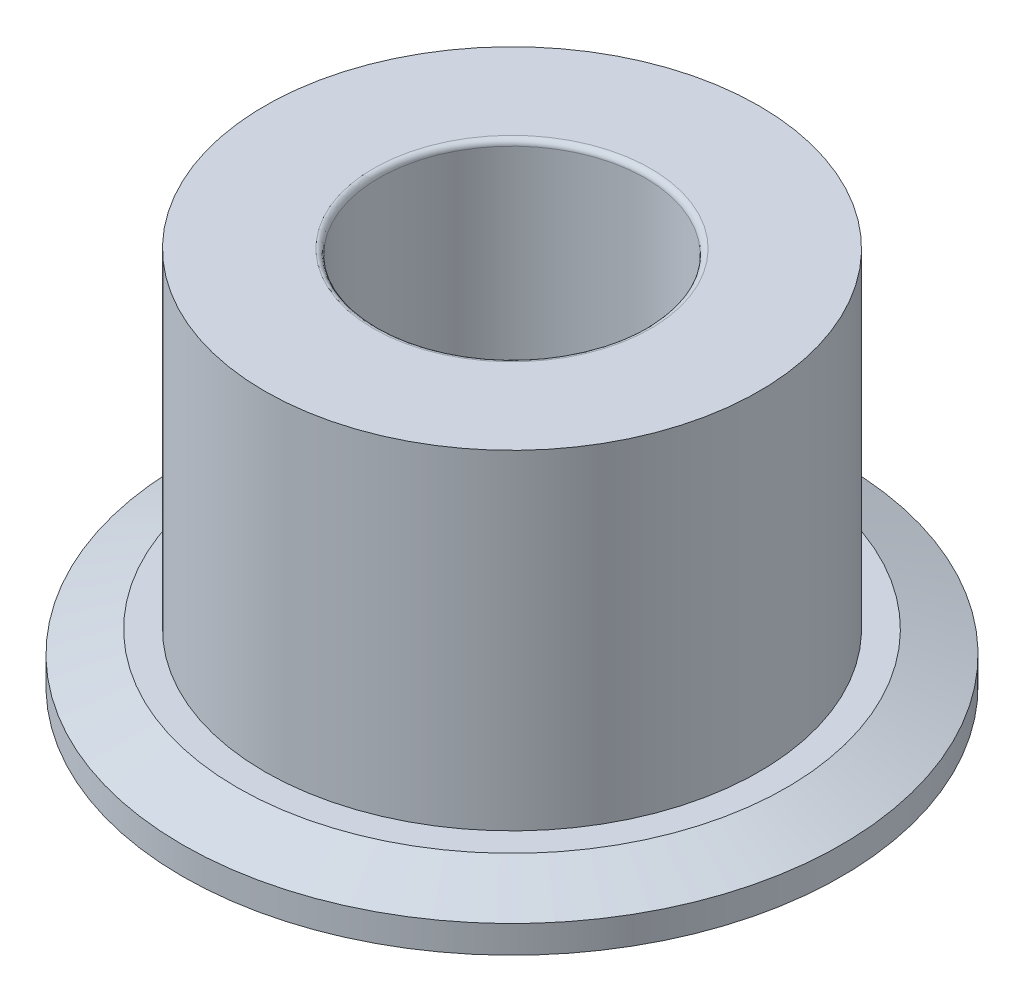
ISO-10303-21;
HEADER;
FILE_DESCRIPTION(('STEP AP214'),'2;1');
FILE_NAME('part.step','',(''),(''),'','','');
FILE_SCHEMA(('AUTOMOTIVE_DESIGN { 1 0 10303 214 1 1 1 1 }'));
ENDSEC;
DATA;
#1=APPLICATION_CONTEXT('core data for automotive mechanical design processes');
#2=APPLICATION_PROTOCOL_DEFINITION('international standard','automotive_design',2000,#1);
#3=PRODUCT_CONTEXT('',#1,'mechanical');
#4=PRODUCT('Part','Part','',(#3));
#5=PRODUCT_RELATED_PRODUCT_CATEGORY('part','',(#4));
#6=PRODUCT_DEFINITION_FORMATION('','',#4);
#7=PRODUCT_DEFINITION_CONTEXT('part definition',#1,'design');
#8=PRODUCT_DEFINITION('design','',#6,#7);
#9=PRODUCT_DEFINITION_SHAPE('','',#8);
#10=(LENGTH_UNIT() NAMED_UNIT(*) SI_UNIT(.MILLI.,.METRE.));
#11=(NAMED_UNIT(*) PLANE_ANGLE_UNIT() SI_UNIT($,.RADIAN.));
#12=(NAMED_UNIT(*) SI_UNIT($,.STERADIAN.) SOLID_ANGLE_UNIT());
#13=UNCERTAINTY_MEASURE_WITH_UNIT(LENGTH_MEASURE(1.E-05),#10,'distance_accuracy_value','');
#14=(GEOMETRIC_REPRESENTATION_CONTEXT(3) GLOBAL_UNCERTAINTY_ASSIGNED_CONTEXT((#13)) GLOBAL_UNIT_ASSIGNED_CONTEXT((#10,
#11,#12)) REPRESENTATION_CONTEXT('',''));
#15=CARTESIAN_POINT('',(0.,0.,0.));
#16=DIRECTION('',(0.,0.,1.));
#17=DIRECTION('',(1.,0.,0.));
#18=AXIS2_PLACEMENT_3D('',#15,#16,#17);
#19=CARTESIAN_POINT('',(0.,0.9,0.));
#20=DIRECTION('',(0.,1.,0.));
#21=DIRECTION('',(0.,0.,1.));
#22=AXIS2_PLACEMENT_3D('',#19,#20,#21);
#23=PLANE('',#22);
#24=CARTESIAN_POINT('',(0.,0.9,0.));
#25=DIRECTION('',(0.,1.,0.));
#26=DIRECTION('',(0.,0.,1.));
#27=AXIS2_PLACEMENT_3D('',#24,#25,#26);
#28=CIRCLE('',#27,4.99999999999999);
#29=CARTESIAN_POINT('',(0.,0.9,4.99999999999999));
#30=VERTEX_POINT('',#29);
#31=EDGE_CURVE('E42',#30,#30,#28,.T.);
#32=ORIENTED_EDGE('',*,*,#31,.T.);
#33=EDGE_LOOP('',(#32));
#34=FACE_BOUND('',#33,.T.);
#35=CARTESIAN_POINT('',(0.,0.9,0.));
#36=DIRECTION('',(0.,1.,0.));
#37=DIRECTION('',(0.,0.,1.));
#38=AXIS2_PLACEMENT_3D('',#35,#36,#37);
#39=CIRCLE('',#38,4.5);
#40=CARTESIAN_POINT('',(0.,0.9,4.5));
#41=VERTEX_POINT('',#40);
#42=EDGE_CURVE('E62',#41,#41,#39,.T.);
#43=ORIENTED_EDGE('',*,*,#42,.F.);
#44=EDGE_LOOP('',(#43));
#45=FACE_BOUND('',#44,.T.);
#46=ADVANCED_FACE('F35',(#34,#45),#23,.T.);
#47=CARTESIAN_POINT('',(0.,0.,0.));
#48=DIRECTION('',(0.,1.,0.));
#49=DIRECTION('',(0.,0.,1.));
#50=AXIS2_PLACEMENT_3D('',#47,#48,#49);
#51=PLANE('',#50);
#52=CARTESIAN_POINT('',(0.,0.,0.));
#53=DIRECTION('',(0.,1.,0.));
#54=DIRECTION('',(0.,0.,1.));
#55=AXIS2_PLACEMENT_3D('',#52,#53,#54);
#56=CIRCLE('',#55,6.);
#57=CARTESIAN_POINT('',(0.,0.,6.));
#58=VERTEX_POINT('',#57);
#59=EDGE_CURVE('E55',#58,#58,#56,.T.);
#60=ORIENTED_EDGE('',*,*,#59,.F.);
#61=EDGE_LOOP('',(#60));
#62=FACE_BOUND('',#61,.T.);
#63=CARTESIAN_POINT('',(0.,0.,0.));
#64=DIRECTION('',(0.,1.,0.));
#65=DIRECTION('',(0.,0.,1.));
#66=AXIS2_PLACEMENT_3D('',#63,#64,#65);
#67=CIRCLE('',#66,2.425);
#68=CARTESIAN_POINT('',(0.,0.,2.425));
#69=VERTEX_POINT('',#68);
#70=EDGE_CURVE('E58',#69,#69,#67,.T.);
#71=ORIENTED_EDGE('',*,*,#70,.T.);
#72=EDGE_LOOP('',(#71));
#73=FACE_BOUND('',#72,.T.);
#74=ADVANCED_FACE('F78',(#62,#73),#51,.F.);
#75=CARTESIAN_POINT('',(0.,0.9,0.));
#76=DIRECTION('',(0.,-1.,0.));
#77=DIRECTION('',(0.,0.,-1.));
#78=AXIS2_PLACEMENT_3D('',#75,#76,#77);
#79=CYLINDRICAL_SURFACE('',#78,6.);
#80=CARTESIAN_POINT('',(0.,0.499999999999997,0.));
#81=DIRECTION('',(0.,1.,0.));
#82=DIRECTION('',(0.,0.,1.));
#83=AXIS2_PLACEMENT_3D('',#80,#81,#82);
#84=CIRCLE('',#83,6.);
#85=CARTESIAN_POINT('',(0.,0.499999999999997,6.));
#86=VERTEX_POINT('',#85);
#87=EDGE_CURVE('E10',#86,#86,#84,.F.);
#88=ORIENTED_EDGE('',*,*,#87,.T.);
#89=EDGE_LOOP('',(#88));
#90=FACE_BOUND('',#89,.T.);
#91=ORIENTED_EDGE('',*,*,#59,.T.);
#92=EDGE_LOOP('',(#91));
#93=FACE_BOUND('',#92,.T.);
#94=ADVANCED_FACE('F83',(#90,#93),#79,.T.);
#95=CARTESIAN_POINT('',(0.,0.9,0.));
#96=DIRECTION('',(0.,-1.,0.));
#97=DIRECTION('',(0.,0.,-1.));
#98=AXIS2_PLACEMENT_3D('',#95,#96,#97);
#99=CYLINDRICAL_SURFACE('',#98,2.425);
#100=CARTESIAN_POINT('',(0.,6.8,0.));
#101=DIRECTION('',(0.,1.,0.));
#102=DIRECTION('',(0.,0.,1.));
#103=AXIS2_PLACEMENT_3D('',#100,#101,#102);
#104=CIRCLE('',#103,2.425);
#105=CARTESIAN_POINT('',(0.,6.8,2.425));
#106=VERTEX_POINT('',#105);
#107=EDGE_CURVE('E50',#106,#106,#104,.T.);
#108=ORIENTED_EDGE('',*,*,#107,.T.);
#109=EDGE_LOOP('',(#108));
#110=FACE_BOUND('',#109,.T.);
#111=ORIENTED_EDGE('',*,*,#70,.F.);
#112=EDGE_LOOP('',(#111));
#113=FACE_BOUND('',#112,.T.);
#114=ADVANCED_FACE('F87',(#110,#113),#99,.F.);
#115=CARTESIAN_POINT('',(0.,6.9,0.));
#116=DIRECTION('',(0.,1.,0.));
#117=DIRECTION('',(0.,0.,1.));
#118=AXIS2_PLACEMENT_3D('',#115,#116,#117);
#119=PLANE('',#118);
#120=CARTESIAN_POINT('',(0.,6.9,0.));
#121=DIRECTION('',(0.,1.,0.));
#122=DIRECTION('',(0.,0.,1.));
#123=AXIS2_PLACEMENT_3D('',#120,#121,#122);
#124=CIRCLE('',#123,2.525);
#125=CARTESIAN_POINT('',(0.,6.9,2.525));
#126=VERTEX_POINT('',#125);
#127=EDGE_CURVE('E46',#126,#126,#124,.F.);
#128=ORIENTED_EDGE('',*,*,#127,.T.);
#129=EDGE_LOOP('',(#128));
#130=FACE_BOUND('',#129,.T.);
#131=CARTESIAN_POINT('',(0.,6.9,0.));
#132=DIRECTION('',(0.,1.,0.));
#133=DIRECTION('',(0.,0.,1.));
#134=AXIS2_PLACEMENT_3D('',#131,#132,#133);
#135=CIRCLE('',#134,4.5);
#136=CARTESIAN_POINT('',(0.,6.9,4.5));
#137=VERTEX_POINT('',#136);
#138=EDGE_CURVE('E61',#137,#137,#135,.T.);
#139=ORIENTED_EDGE('',*,*,#138,.T.);
#140=EDGE_LOOP('',(#139));
#141=FACE_BOUND('',#140,.T.);
#142=ADVANCED_FACE('F68',(#130,#141),#119,.T.);
#143=CARTESIAN_POINT('',(0.,6.9,0.));
#144=DIRECTION('',(0.,-1.,0.));
#145=DIRECTION('',(0.,0.,-1.));
#146=AXIS2_PLACEMENT_3D('',#143,#144,#145);
#147=CYLINDRICAL_SURFACE('',#146,4.5);
#148=ORIENTED_EDGE('',*,*,#138,.F.);
#149=EDGE_LOOP('',(#148));
#150=FACE_BOUND('',#149,.T.);
#151=ORIENTED_EDGE('',*,*,#42,.T.);
#152=EDGE_LOOP('',(#151));
#153=FACE_BOUND('',#152,.T.);
#154=ADVANCED_FACE('F70',(#150,#153),#147,.T.);
#155=CARTESIAN_POINT('',(0.,6.8,0.));
#156=DIRECTION('',(0.,1.,0.));
#157=DIRECTION('',(0.,0.,1.));
#158=AXIS2_PLACEMENT_3D('',#155,#156,#157);
#159=TOROIDAL_SURFACE('',#158,2.525,0.1);
#160=ORIENTED_EDGE('',*,*,#127,.F.);
#161=EDGE_LOOP('',(#160));
#162=FACE_BOUND('',#161,.T.);
#163=ORIENTED_EDGE('',*,*,#107,.F.);
#164=EDGE_LOOP('',(#163));
#165=FACE_BOUND('',#164,.T.);
#166=ADVANCED_FACE('F73',(#162,#165),#159,.T.);
#167=CARTESIAN_POINT('',(0.,0.9,0.));
#168=DIRECTION('',(0.,-1.,0.));
#169=DIRECTION('',(0.,0.,-1.));
#170=AXIS2_PLACEMENT_3D('',#167,#168,#169);
#171=CONICAL_SURFACE('',#170,4.99999999999999,1.19028994968253);
#172=ORIENTED_EDGE('',*,*,#87,.F.);
#173=EDGE_LOOP('',(#172));
#174=FACE_BOUND('',#173,.T.);
#175=ORIENTED_EDGE('',*,*,#31,.F.);
#176=EDGE_LOOP('',(#175));
#177=FACE_BOUND('',#176,.T.);
#178=ADVANCED_FACE('F37',(#174,#177),#171,.T.);
#179=CLOSED_SHELL('',(#46,#74,#94,#114,#142,#154,#166,#178));
#180=MANIFOLD_SOLID_BREP('B2',#179);
#181=ADVANCED_BREP_SHAPE_REPRESENTATION('',(#18,#180),#14);
#182=SHAPE_DEFINITION_REPRESENTATION(#9,#181);
ENDSEC;
END-ISO-10303-21;
